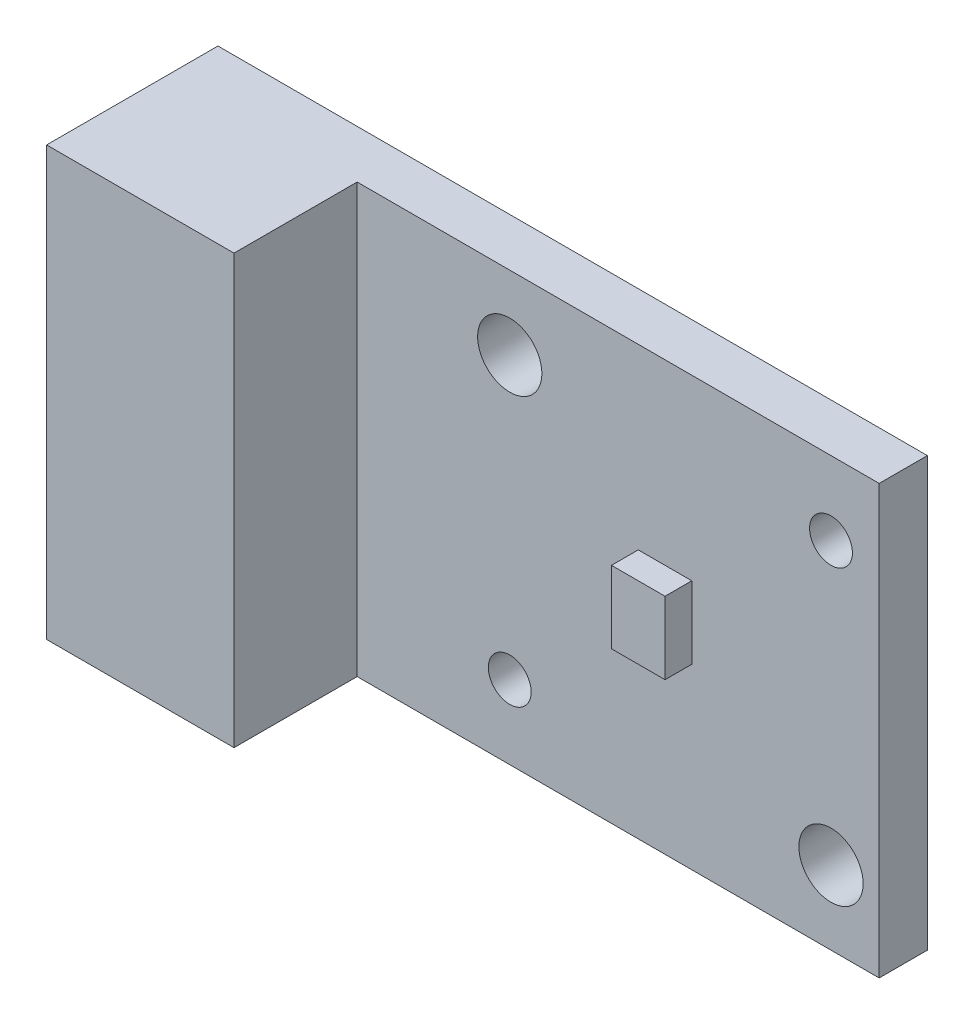
ISO-10303-21;
HEADER;
FILE_DESCRIPTION(('STEP AP214'),'2;1');
FILE_NAME('part.step','',(''),(''),'','','');
FILE_SCHEMA(('AUTOMOTIVE_DESIGN { 1 0 10303 214 1 1 1 1 }'));
ENDSEC;
DATA;
#1=APPLICATION_CONTEXT('core data for automotive mechanical design processes');
#2=APPLICATION_PROTOCOL_DEFINITION('international standard','automotive_design',2000,#1);
#3=PRODUCT_CONTEXT('',#1,'mechanical');
#4=PRODUCT('Part','Part','',(#3));
#5=PRODUCT_RELATED_PRODUCT_CATEGORY('part','',(#4));
#6=PRODUCT_DEFINITION_FORMATION('','',#4);
#7=PRODUCT_DEFINITION_CONTEXT('part definition',#1,'design');
#8=PRODUCT_DEFINITION('design','',#6,#7);
#9=PRODUCT_DEFINITION_SHAPE('','',#8);
#10=(LENGTH_UNIT() NAMED_UNIT(*) SI_UNIT(.MILLI.,.METRE.));
#11=(NAMED_UNIT(*) PLANE_ANGLE_UNIT() SI_UNIT($,.RADIAN.));
#12=(NAMED_UNIT(*) SI_UNIT($,.STERADIAN.) SOLID_ANGLE_UNIT());
#13=UNCERTAINTY_MEASURE_WITH_UNIT(LENGTH_MEASURE(1.E-05),#10,'distance_accuracy_value','');
#14=(GEOMETRIC_REPRESENTATION_CONTEXT(3) GLOBAL_UNCERTAINTY_ASSIGNED_CONTEXT((#13)) GLOBAL_UNIT_ASSIGNED_CONTEXT((#10,
#11,#12)) REPRESENTATION_CONTEXT('',''));
#15=CARTESIAN_POINT('',(0.,0.,0.));
#16=DIRECTION('',(0.,0.,1.));
#17=DIRECTION('',(1.,0.,0.));
#18=AXIS2_PLACEMENT_3D('',#15,#16,#17);
#19=CARTESIAN_POINT('',(0.,0.,1.8));
#20=DIRECTION('',(0.,0.,-1.));
#21=DIRECTION('',(-1.,0.,0.));
#22=AXIS2_PLACEMENT_3D('',#19,#20,#21);
#23=PLANE('',#22);
#24=CARTESIAN_POINT('',(12.7,13.25,1.8));
#25=DIRECTION('',(0.,0.,1.));
#26=DIRECTION('',(1.,0.,0.));
#27=AXIS2_PLACEMENT_3D('',#24,#25,#26);
#28=CIRCLE('',#27,1.2);
#29=CARTESIAN_POINT('',(13.9,13.25,1.8));
#30=VERTEX_POINT('',#29);
#31=EDGE_CURVE('E369',#30,#30,#28,.T.);
#32=ORIENTED_EDGE('',*,*,#31,.F.);
#33=EDGE_LOOP('',(#32));
#34=FACE_BOUND('',#33,.T.);
#35=CARTESIAN_POINT('',(24.7,2.75,1.8));
#36=DIRECTION('',(0.,0.,1.));
#37=DIRECTION('',(1.,0.,0.));
#38=AXIS2_PLACEMENT_3D('',#35,#36,#37);
#39=CIRCLE('',#38,1.2);
#40=CARTESIAN_POINT('',(25.9,2.75,1.8));
#41=VERTEX_POINT('',#40);
#42=EDGE_CURVE('E371',#41,#41,#39,.T.);
#43=ORIENTED_EDGE('',*,*,#42,.F.);
#44=EDGE_LOOP('',(#43));
#45=FACE_BOUND('',#44,.T.);
#46=CARTESIAN_POINT('',(12.7,2.75,1.8));
#47=DIRECTION('',(0.,0.,1.));
#48=DIRECTION('',(1.,0.,0.));
#49=AXIS2_PLACEMENT_3D('',#46,#47,#48);
#50=CIRCLE('',#49,0.800000000000001);
#51=CARTESIAN_POINT('',(13.5,2.75,1.8));
#52=VERTEX_POINT('',#51);
#53=EDGE_CURVE('E395',#52,#52,#50,.T.);
#54=ORIENTED_EDGE('',*,*,#53,.F.);
#55=EDGE_LOOP('',(#54));
#56=FACE_BOUND('',#55,.T.);
#57=CARTESIAN_POINT('',(24.7,13.25,1.8));
#58=DIRECTION('',(0.,0.,1.));
#59=DIRECTION('',(1.,0.,0.));
#60=AXIS2_PLACEMENT_3D('',#57,#58,#59);
#61=CIRCLE('',#60,0.799999999999999);
#62=CARTESIAN_POINT('',(25.5,13.25,1.8));
#63=VERTEX_POINT('',#62);
#64=EDGE_CURVE('E378',#63,#63,#61,.T.);
#65=ORIENTED_EDGE('',*,*,#64,.F.);
#66=EDGE_LOOP('',(#65));
#67=FACE_BOUND('',#66,.T.);
#68=DIRECTION('',(0.,1.,0.));
#69=VECTOR('',#68,1.);
#70=CARTESIAN_POINT('',(7.,0.,1.8));
#71=LINE('',#70,#69);
#72=CARTESIAN_POINT('',(7.,0.,1.8));
#73=VERTEX_POINT('',#72);
#74=CARTESIAN_POINT('',(7.,16.,1.8));
#75=VERTEX_POINT('',#74);
#76=EDGE_CURVE('E132',#73,#75,#71,.T.);
#77=ORIENTED_EDGE('',*,*,#76,.F.);
#78=DIRECTION('',(1.,0.,0.));
#79=VECTOR('',#78,1.);
#80=CARTESIAN_POINT('',(0.,0.,1.8));
#81=LINE('',#80,#79);
#82=CARTESIAN_POINT('',(26.5,0.,1.8));
#83=VERTEX_POINT('',#82);
#84=EDGE_CURVE('E157',#73,#83,#81,.T.);
#85=ORIENTED_EDGE('',*,*,#84,.T.);
#86=DIRECTION('',(0.,1.,0.));
#87=VECTOR('',#86,1.);
#88=CARTESIAN_POINT('',(26.5,0.,1.8));
#89=LINE('',#88,#87);
#90=CARTESIAN_POINT('',(26.5,16.,1.8));
#91=VERTEX_POINT('',#90);
#92=EDGE_CURVE('E159',#83,#91,#89,.T.);
#93=ORIENTED_EDGE('',*,*,#92,.T.);
#94=DIRECTION('',(-1.,0.,0.));
#95=VECTOR('',#94,1.);
#96=CARTESIAN_POINT('',(0.,16.,1.8));
#97=LINE('',#96,#95);
#98=EDGE_CURVE('E162',#91,#75,#97,.T.);
#99=ORIENTED_EDGE('',*,*,#98,.T.);
#100=EDGE_LOOP('',(#77,#85,#93,#99));
#101=FACE_BOUND('',#100,.T.);
#102=DIRECTION('',(0.,1.,0.));
#103=VECTOR('',#102,1.);
#104=CARTESIAN_POINT('',(19.5,6.65,1.8));
#105=LINE('',#104,#103);
#106=CARTESIAN_POINT('',(19.5,6.65,1.8));
#107=VERTEX_POINT('',#106);
#108=CARTESIAN_POINT('',(19.5,9.35,1.8));
#109=VERTEX_POINT('',#108);
#110=EDGE_CURVE('E131',#107,#109,#105,.T.);
#111=ORIENTED_EDGE('',*,*,#110,.F.);
#112=DIRECTION('',(1.,0.,0.));
#113=VECTOR('',#112,1.);
#114=CARTESIAN_POINT('',(17.5,6.65,1.8));
#115=LINE('',#114,#113);
#116=CARTESIAN_POINT('',(17.5,6.65,1.8));
#117=VERTEX_POINT('',#116);
#118=EDGE_CURVE('E128',#117,#107,#115,.T.);
#119=ORIENTED_EDGE('',*,*,#118,.F.);
#120=DIRECTION('',(0.,-1.,0.));
#121=VECTOR('',#120,1.);
#122=CARTESIAN_POINT('',(17.5,6.65,1.8));
#123=LINE('',#122,#121);
#124=CARTESIAN_POINT('',(17.5,9.35,1.8));
#125=VERTEX_POINT('',#124);
#126=EDGE_CURVE('E54',#125,#117,#123,.T.);
#127=ORIENTED_EDGE('',*,*,#126,.F.);
#128=DIRECTION('',(-1.,0.,0.));
#129=VECTOR('',#128,1.);
#130=CARTESIAN_POINT('',(17.5,9.35,1.8));
#131=LINE('',#130,#129);
#132=EDGE_CURVE('E49',#109,#125,#131,.T.);
#133=ORIENTED_EDGE('',*,*,#132,.F.);
#134=EDGE_LOOP('',(#111,#119,#127,#133));
#135=FACE_BOUND('',#134,.T.);
#136=ADVANCED_FACE('F34',(#34,#45,#56,#67,#101,#135),#23,.F.);
#137=CARTESIAN_POINT('',(0.,0.,1.8));
#138=DIRECTION('',(1.,0.,0.));
#139=DIRECTION('',(0.,0.,-1.));
#140=AXIS2_PLACEMENT_3D('',#137,#138,#139);
#141=PLANE('',#140);
#142=DIRECTION('',(0.,-1.,0.));
#143=VECTOR('',#142,1.);
#144=CARTESIAN_POINT('',(0.,0.,0.));
#145=LINE('',#144,#143);
#146=CARTESIAN_POINT('',(0.,16.,0.));
#147=VERTEX_POINT('',#146);
#148=CARTESIAN_POINT('',(0.,0.,0.));
#149=VERTEX_POINT('',#148);
#150=EDGE_CURVE('E156',#147,#149,#145,.T.);
#151=ORIENTED_EDGE('',*,*,#150,.T.);
#152=DIRECTION('',(0.,0.,-1.));
#153=VECTOR('',#152,1.);
#154=CARTESIAN_POINT('',(0.,0.,1.8));
#155=LINE('',#154,#153);
#156=CARTESIAN_POINT('',(0.,0.,6.4));
#157=VERTEX_POINT('',#156);
#158=EDGE_CURVE('E11',#157,#149,#155,.T.);
#159=ORIENTED_EDGE('',*,*,#158,.F.);
#160=DIRECTION('',(0.,-1.,0.));
#161=VECTOR('',#160,1.);
#162=CARTESIAN_POINT('',(0.,0.,6.4));
#163=LINE('',#162,#161);
#164=CARTESIAN_POINT('',(0.,16.,6.4));
#165=VERTEX_POINT('',#164);
#166=EDGE_CURVE('E135',#165,#157,#163,.T.);
#167=ORIENTED_EDGE('',*,*,#166,.F.);
#168=DIRECTION('',(0.,0.,-1.));
#169=VECTOR('',#168,1.);
#170=CARTESIAN_POINT('',(0.,16.,1.8));
#171=LINE('',#170,#169);
#172=EDGE_CURVE('E164',#165,#147,#171,.T.);
#173=ORIENTED_EDGE('',*,*,#172,.T.);
#174=EDGE_LOOP('',(#151,#159,#167,#173));
#175=FACE_BOUND('',#174,.T.);
#176=ADVANCED_FACE('F36',(#175),#141,.F.);
#177=CARTESIAN_POINT('',(0.,0.,1.8));
#178=DIRECTION('',(0.,1.,0.));
#179=DIRECTION('',(0.,0.,1.));
#180=AXIS2_PLACEMENT_3D('',#177,#178,#179);
#181=PLANE('',#180);
#182=DIRECTION('',(1.,0.,0.));
#183=VECTOR('',#182,1.);
#184=CARTESIAN_POINT('',(0.,0.,0.));
#185=LINE('',#184,#183);
#186=CARTESIAN_POINT('',(26.5,0.,0.));
#187=VERTEX_POINT('',#186);
#188=EDGE_CURVE('E167',#149,#187,#185,.T.);
#189=ORIENTED_EDGE('',*,*,#188,.T.);
#190=DIRECTION('',(0.,0.,-1.));
#191=VECTOR('',#190,1.);
#192=CARTESIAN_POINT('',(26.5,0.,1.8));
#193=LINE('',#192,#191);
#194=EDGE_CURVE('E42',#83,#187,#193,.T.);
#195=ORIENTED_EDGE('',*,*,#194,.F.);
#196=ORIENTED_EDGE('',*,*,#84,.F.);
#197=DIRECTION('',(0.,0.,-1.));
#198=VECTOR('',#197,1.);
#199=CARTESIAN_POINT('',(7.,0.,6.4));
#200=LINE('',#199,#198);
#201=CARTESIAN_POINT('',(7.,0.,6.4));
#202=VERTEX_POINT('',#201);
#203=EDGE_CURVE('E153',#202,#73,#200,.T.);
#204=ORIENTED_EDGE('',*,*,#203,.F.);
#205=DIRECTION('',(1.,0.,0.));
#206=VECTOR('',#205,1.);
#207=CARTESIAN_POINT('',(0.,0.,6.4));
#208=LINE('',#207,#206);
#209=EDGE_CURVE('E143',#157,#202,#208,.T.);
#210=ORIENTED_EDGE('',*,*,#209,.F.);
#211=ORIENTED_EDGE('',*,*,#158,.T.);
#212=EDGE_LOOP('',(#189,#195,#196,#204,#210,#211));
#213=FACE_BOUND('',#212,.T.);
#214=ADVANCED_FACE('F204',(#213),#181,.F.);
#215=CARTESIAN_POINT('',(26.5,0.,1.8));
#216=DIRECTION('',(-1.,0.,0.));
#217=DIRECTION('',(0.,0.,1.));
#218=AXIS2_PLACEMENT_3D('',#215,#216,#217);
#219=PLANE('',#218);
#220=DIRECTION('',(0.,1.,0.));
#221=VECTOR('',#220,1.);
#222=CARTESIAN_POINT('',(26.5,0.,0.));
#223=LINE('',#222,#221);
#224=CARTESIAN_POINT('',(26.5,16.,0.));
#225=VERTEX_POINT('',#224);
#226=EDGE_CURVE('E169',#187,#225,#223,.T.);
#227=ORIENTED_EDGE('',*,*,#226,.T.);
#228=DIRECTION('',(0.,0.,-1.));
#229=VECTOR('',#228,1.);
#230=CARTESIAN_POINT('',(26.5,16.,1.8));
#231=LINE('',#230,#229);
#232=EDGE_CURVE('E174',#91,#225,#231,.T.);
#233=ORIENTED_EDGE('',*,*,#232,.F.);
#234=ORIENTED_EDGE('',*,*,#92,.F.);
#235=ORIENTED_EDGE('',*,*,#194,.T.);
#236=EDGE_LOOP('',(#227,#233,#234,#235));
#237=FACE_BOUND('',#236,.T.);
#238=ADVANCED_FACE('F181',(#237),#219,.F.);
#239=CARTESIAN_POINT('',(0.,16.,1.8));
#240=DIRECTION('',(0.,-1.,0.));
#241=DIRECTION('',(0.,0.,-1.));
#242=AXIS2_PLACEMENT_3D('',#239,#240,#241);
#243=PLANE('',#242);
#244=DIRECTION('',(-1.,0.,0.));
#245=VECTOR('',#244,1.);
#246=CARTESIAN_POINT('',(0.,16.,0.));
#247=LINE('',#246,#245);
#248=EDGE_CURVE('E160',#225,#147,#247,.T.);
#249=ORIENTED_EDGE('',*,*,#248,.T.);
#250=ORIENTED_EDGE('',*,*,#172,.F.);
#251=DIRECTION('',(-1.,0.,0.));
#252=VECTOR('',#251,1.);
#253=CARTESIAN_POINT('',(0.,16.,6.4));
#254=LINE('',#253,#252);
#255=CARTESIAN_POINT('',(7.,16.,6.4));
#256=VERTEX_POINT('',#255);
#257=EDGE_CURVE('E147',#256,#165,#254,.T.);
#258=ORIENTED_EDGE('',*,*,#257,.F.);
#259=DIRECTION('',(0.,0.,-1.));
#260=VECTOR('',#259,1.);
#261=CARTESIAN_POINT('',(7.,16.,6.4));
#262=LINE('',#261,#260);
#263=EDGE_CURVE('E149',#256,#75,#262,.T.);
#264=ORIENTED_EDGE('',*,*,#263,.T.);
#265=ORIENTED_EDGE('',*,*,#98,.F.);
#266=ORIENTED_EDGE('',*,*,#232,.T.);
#267=EDGE_LOOP('',(#249,#250,#258,#264,#265,#266));
#268=FACE_BOUND('',#267,.T.);
#269=ADVANCED_FACE('F190',(#268),#243,.F.);
#270=CARTESIAN_POINT('',(0.,0.,0.));
#271=DIRECTION('',(0.,0.,-1.));
#272=DIRECTION('',(-1.,0.,0.));
#273=AXIS2_PLACEMENT_3D('',#270,#271,#272);
#274=PLANE('',#273);
#275=CARTESIAN_POINT('',(12.7,13.25,0.));
#276=DIRECTION('',(0.,0.,1.));
#277=DIRECTION('',(1.,0.,0.));
#278=AXIS2_PLACEMENT_3D('',#275,#276,#277);
#279=CIRCLE('',#278,1.2);
#280=CARTESIAN_POINT('',(13.9,13.25,0.));
#281=VERTEX_POINT('',#280);
#282=EDGE_CURVE('E367',#281,#281,#279,.T.);
#283=ORIENTED_EDGE('',*,*,#282,.T.);
#284=EDGE_LOOP('',(#283));
#285=FACE_BOUND('',#284,.T.);
#286=CARTESIAN_POINT('',(24.7,2.75,0.));
#287=DIRECTION('',(0.,0.,1.));
#288=DIRECTION('',(1.,0.,0.));
#289=AXIS2_PLACEMENT_3D('',#286,#287,#288);
#290=CIRCLE('',#289,1.2);
#291=CARTESIAN_POINT('',(25.9,2.75,0.));
#292=VERTEX_POINT('',#291);
#293=EDGE_CURVE('E400',#292,#292,#290,.T.);
#294=ORIENTED_EDGE('',*,*,#293,.T.);
#295=EDGE_LOOP('',(#294));
#296=FACE_BOUND('',#295,.T.);
#297=CARTESIAN_POINT('',(12.7,2.75,0.));
#298=DIRECTION('',(0.,0.,1.));
#299=DIRECTION('',(1.,0.,0.));
#300=AXIS2_PLACEMENT_3D('',#297,#298,#299);
#301=CIRCLE('',#300,0.800000000000001);
#302=CARTESIAN_POINT('',(13.5,2.75,0.));
#303=VERTEX_POINT('',#302);
#304=EDGE_CURVE('E380',#303,#303,#301,.T.);
#305=ORIENTED_EDGE('',*,*,#304,.T.);
#306=EDGE_LOOP('',(#305));
#307=FACE_BOUND('',#306,.T.);
#308=CARTESIAN_POINT('',(24.7,13.25,0.));
#309=DIRECTION('',(0.,0.,1.));
#310=DIRECTION('',(1.,0.,0.));
#311=AXIS2_PLACEMENT_3D('',#308,#309,#310);
#312=CIRCLE('',#311,0.799999999999999);
#313=CARTESIAN_POINT('',(25.5,13.25,0.));
#314=VERTEX_POINT('',#313);
#315=EDGE_CURVE('E375',#314,#314,#312,.T.);
#316=ORIENTED_EDGE('',*,*,#315,.T.);
#317=EDGE_LOOP('',(#316));
#318=FACE_BOUND('',#317,.T.);
#319=ORIENTED_EDGE('',*,*,#150,.F.);
#320=ORIENTED_EDGE('',*,*,#248,.F.);
#321=ORIENTED_EDGE('',*,*,#226,.F.);
#322=ORIENTED_EDGE('',*,*,#188,.F.);
#323=EDGE_LOOP('',(#319,#320,#321,#322));
#324=FACE_BOUND('',#323,.T.);
#325=ADVANCED_FACE('F188',(#285,#296,#307,#318,#324),#274,.T.);
#326=CARTESIAN_POINT('',(7.,0.,6.4));
#327=DIRECTION('',(-1.,0.,0.));
#328=DIRECTION('',(0.,-1.,0.));
#329=AXIS2_PLACEMENT_3D('',#326,#327,#328);
#330=PLANE('',#329);
#331=ORIENTED_EDGE('',*,*,#76,.T.);
#332=ORIENTED_EDGE('',*,*,#263,.F.);
#333=DIRECTION('',(0.,1.,0.));
#334=VECTOR('',#333,1.);
#335=CARTESIAN_POINT('',(7.,0.,6.4));
#336=LINE('',#335,#334);
#337=EDGE_CURVE('E145',#202,#256,#336,.T.);
#338=ORIENTED_EDGE('',*,*,#337,.F.);
#339=ORIENTED_EDGE('',*,*,#203,.T.);
#340=EDGE_LOOP('',(#331,#332,#338,#339));
#341=FACE_BOUND('',#340,.T.);
#342=ADVANCED_FACE('F202',(#341),#330,.F.);
#343=CARTESIAN_POINT('',(0.,0.,6.4));
#344=DIRECTION('',(0.,0.,-1.));
#345=DIRECTION('',(-1.,0.,0.));
#346=AXIS2_PLACEMENT_3D('',#343,#344,#345);
#347=PLANE('',#346);
#348=ORIENTED_EDGE('',*,*,#166,.T.);
#349=ORIENTED_EDGE('',*,*,#209,.T.);
#350=ORIENTED_EDGE('',*,*,#337,.T.);
#351=ORIENTED_EDGE('',*,*,#257,.T.);
#352=EDGE_LOOP('',(#348,#349,#350,#351));
#353=FACE_BOUND('',#352,.T.);
#354=ADVANCED_FACE('F197',(#353),#347,.F.);
#355=CARTESIAN_POINT('',(19.5,6.65,2.8));
#356=DIRECTION('',(-1.,0.,0.));
#357=DIRECTION('',(0.,0.,1.));
#358=AXIS2_PLACEMENT_3D('',#355,#356,#357);
#359=PLANE('',#358);
#360=ORIENTED_EDGE('',*,*,#110,.T.);
#361=DIRECTION('',(0.,0.,-1.));
#362=VECTOR('',#361,1.);
#363=CARTESIAN_POINT('',(19.5,9.35,2.8));
#364=LINE('',#363,#362);
#365=CARTESIAN_POINT('',(19.5,9.35,2.8));
#366=VERTEX_POINT('',#365);
#367=EDGE_CURVE('E112',#366,#109,#364,.T.);
#368=ORIENTED_EDGE('',*,*,#367,.F.);
#369=DIRECTION('',(0.,1.,0.));
#370=VECTOR('',#369,1.);
#371=CARTESIAN_POINT('',(19.5,6.65,2.8));
#372=LINE('',#371,#370);
#373=CARTESIAN_POINT('',(19.5,6.65,2.8));
#374=VERTEX_POINT('',#373);
#375=EDGE_CURVE('E119',#374,#366,#372,.T.);
#376=ORIENTED_EDGE('',*,*,#375,.F.);
#377=DIRECTION('',(0.,0.,-1.));
#378=VECTOR('',#377,1.);
#379=CARTESIAN_POINT('',(19.5,6.65,2.8));
#380=LINE('',#379,#378);
#381=EDGE_CURVE('E384',#374,#107,#380,.T.);
#382=ORIENTED_EDGE('',*,*,#381,.T.);
#383=EDGE_LOOP('',(#360,#368,#376,#382));
#384=FACE_BOUND('',#383,.T.);
#385=ADVANCED_FACE('F130',(#384),#359,.F.);
#386=CARTESIAN_POINT('',(17.5,9.35,2.8));
#387=DIRECTION('',(0.,-1.,0.));
#388=DIRECTION('',(0.,0.,-1.));
#389=AXIS2_PLACEMENT_3D('',#386,#387,#388);
#390=PLANE('',#389);
#391=ORIENTED_EDGE('',*,*,#132,.T.);
#392=DIRECTION('',(0.,0.,-1.));
#393=VECTOR('',#392,1.);
#394=CARTESIAN_POINT('',(17.5,9.35,2.8));
#395=LINE('',#394,#393);
#396=CARTESIAN_POINT('',(17.5,9.35,2.8));
#397=VERTEX_POINT('',#396);
#398=EDGE_CURVE('E115',#397,#125,#395,.T.);
#399=ORIENTED_EDGE('',*,*,#398,.F.);
#400=DIRECTION('',(-1.,0.,0.));
#401=VECTOR('',#400,1.);
#402=CARTESIAN_POINT('',(17.5,9.35,2.8));
#403=LINE('',#402,#401);
#404=EDGE_CURVE('E108',#366,#397,#403,.T.);
#405=ORIENTED_EDGE('',*,*,#404,.F.);
#406=ORIENTED_EDGE('',*,*,#367,.T.);
#407=EDGE_LOOP('',(#391,#399,#405,#406));
#408=FACE_BOUND('',#407,.T.);
#409=ADVANCED_FACE('F110',(#408),#390,.F.);
#410=CARTESIAN_POINT('',(17.5,6.65,2.8));
#411=DIRECTION('',(1.,0.,0.));
#412=DIRECTION('',(0.,0.,-1.));
#413=AXIS2_PLACEMENT_3D('',#410,#411,#412);
#414=PLANE('',#413);
#415=ORIENTED_EDGE('',*,*,#126,.T.);
#416=DIRECTION('',(0.,0.,-1.));
#417=VECTOR('',#416,1.);
#418=CARTESIAN_POINT('',(17.5,6.65,2.8));
#419=LINE('',#418,#417);
#420=CARTESIAN_POINT('',(17.5,6.65,2.8));
#421=VERTEX_POINT('',#420);
#422=EDGE_CURVE('E137',#421,#117,#419,.T.);
#423=ORIENTED_EDGE('',*,*,#422,.F.);
#424=DIRECTION('',(0.,-1.,0.));
#425=VECTOR('',#424,1.);
#426=CARTESIAN_POINT('',(17.5,6.65,2.8));
#427=LINE('',#426,#425);
#428=EDGE_CURVE('E118',#397,#421,#427,.T.);
#429=ORIENTED_EDGE('',*,*,#428,.F.);
#430=ORIENTED_EDGE('',*,*,#398,.T.);
#431=EDGE_LOOP('',(#415,#423,#429,#430));
#432=FACE_BOUND('',#431,.T.);
#433=ADVANCED_FACE('F256',(#432),#414,.F.);
#434=CARTESIAN_POINT('',(17.5,6.65,2.8));
#435=DIRECTION('',(0.,1.,0.));
#436=DIRECTION('',(0.,0.,1.));
#437=AXIS2_PLACEMENT_3D('',#434,#435,#436);
#438=PLANE('',#437);
#439=ORIENTED_EDGE('',*,*,#118,.T.);
#440=ORIENTED_EDGE('',*,*,#381,.F.);
#441=DIRECTION('',(1.,0.,0.));
#442=VECTOR('',#441,1.);
#443=CARTESIAN_POINT('',(17.5,6.65,2.8));
#444=LINE('',#443,#442);
#445=EDGE_CURVE('E124',#421,#374,#444,.T.);
#446=ORIENTED_EDGE('',*,*,#445,.F.);
#447=ORIENTED_EDGE('',*,*,#422,.T.);
#448=EDGE_LOOP('',(#439,#440,#446,#447));
#449=FACE_BOUND('',#448,.T.);
#450=ADVANCED_FACE('F263',(#449),#438,.F.);
#451=CARTESIAN_POINT('',(0.,0.,2.8));
#452=DIRECTION('',(0.,0.,-1.));
#453=DIRECTION('',(-1.,0.,0.));
#454=AXIS2_PLACEMENT_3D('',#451,#452,#453);
#455=PLANE('',#454);
#456=ORIENTED_EDGE('',*,*,#375,.T.);
#457=ORIENTED_EDGE('',*,*,#404,.T.);
#458=ORIENTED_EDGE('',*,*,#428,.T.);
#459=ORIENTED_EDGE('',*,*,#445,.T.);
#460=EDGE_LOOP('',(#456,#457,#458,#459));
#461=FACE_BOUND('',#460,.T.);
#462=ADVANCED_FACE('F122',(#461),#455,.F.);
#463=CARTESIAN_POINT('',(24.7,13.25,0.));
#464=DIRECTION('',(0.,0.,1.));
#465=DIRECTION('',(1.,0.,0.));
#466=AXIS2_PLACEMENT_3D('',#463,#464,#465);
#467=CYLINDRICAL_SURFACE('',#466,0.799999999999999);
#468=ORIENTED_EDGE('',*,*,#315,.F.);
#469=EDGE_LOOP('',(#468));
#470=FACE_BOUND('',#469,.T.);
#471=ORIENTED_EDGE('',*,*,#64,.T.);
#472=EDGE_LOOP('',(#471));
#473=FACE_BOUND('',#472,.T.);
#474=ADVANCED_FACE('F278',(#470,#473),#467,.F.);
#475=CARTESIAN_POINT('',(12.7,2.75,0.));
#476=DIRECTION('',(0.,0.,1.));
#477=DIRECTION('',(1.,0.,0.));
#478=AXIS2_PLACEMENT_3D('',#475,#476,#477);
#479=CYLINDRICAL_SURFACE('',#478,0.800000000000001);
#480=ORIENTED_EDGE('',*,*,#304,.F.);
#481=EDGE_LOOP('',(#480));
#482=FACE_BOUND('',#481,.T.);
#483=ORIENTED_EDGE('',*,*,#53,.T.);
#484=EDGE_LOOP('',(#483));
#485=FACE_BOUND('',#484,.T.);
#486=ADVANCED_FACE('F284',(#482,#485),#479,.F.);
#487=CARTESIAN_POINT('',(24.7,2.75,0.));
#488=DIRECTION('',(0.,0.,1.));
#489=DIRECTION('',(1.,0.,0.));
#490=AXIS2_PLACEMENT_3D('',#487,#488,#489);
#491=CYLINDRICAL_SURFACE('',#490,1.2);
#492=ORIENTED_EDGE('',*,*,#293,.F.);
#493=EDGE_LOOP('',(#492));
#494=FACE_BOUND('',#493,.T.);
#495=ORIENTED_EDGE('',*,*,#42,.T.);
#496=EDGE_LOOP('',(#495));
#497=FACE_BOUND('',#496,.T.);
#498=ADVANCED_FACE('F292',(#494,#497),#491,.F.);
#499=CARTESIAN_POINT('',(12.7,13.25,0.));
#500=DIRECTION('',(0.,0.,1.));
#501=DIRECTION('',(1.,0.,0.));
#502=AXIS2_PLACEMENT_3D('',#499,#500,#501);
#503=CYLINDRICAL_SURFACE('',#502,1.2);
#504=ORIENTED_EDGE('',*,*,#282,.F.);
#505=EDGE_LOOP('',(#504));
#506=FACE_BOUND('',#505,.T.);
#507=ORIENTED_EDGE('',*,*,#31,.T.);
#508=EDGE_LOOP('',(#507));
#509=FACE_BOUND('',#508,.T.);
#510=ADVANCED_FACE('F300',(#506,#509),#503,.F.);
#511=CLOSED_SHELL('',(#136,#176,#214,#238,#269,#325,#342,#354,#385,#409,#433,#450,#462,#474,
#486,#498,#510));
#512=MANIFOLD_SOLID_BREP('B2',#511);
#513=ADVANCED_BREP_SHAPE_REPRESENTATION('',(#18,#512),#14);
#514=SHAPE_DEFINITION_REPRESENTATION(#9,#513);
ENDSEC;
END-ISO-10303-21;
